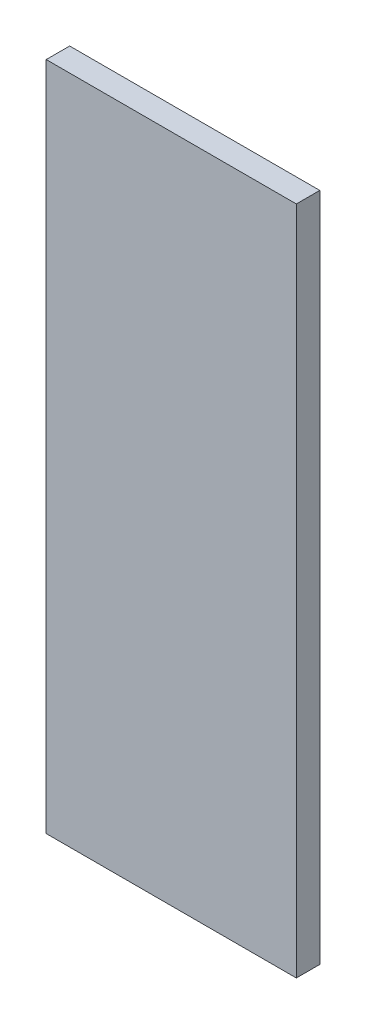
ISO-10303-21;
HEADER;
FILE_DESCRIPTION(('STEP AP214'),'2;1');
FILE_NAME('part.step','',(''),(''),'','','');
FILE_SCHEMA(('AUTOMOTIVE_DESIGN { 1 0 10303 214 1 1 1 1 }'));
ENDSEC;
DATA;
#1=APPLICATION_CONTEXT('core data for automotive mechanical design processes');
#2=APPLICATION_PROTOCOL_DEFINITION('international standard','automotive_design',2000,#1);
#3=PRODUCT_CONTEXT('',#1,'mechanical');
#4=PRODUCT('Part','Part','',(#3));
#5=PRODUCT_RELATED_PRODUCT_CATEGORY('part','',(#4));
#6=PRODUCT_DEFINITION_FORMATION('','',#4);
#7=PRODUCT_DEFINITION_CONTEXT('part definition',#1,'design');
#8=PRODUCT_DEFINITION('design','',#6,#7);
#9=PRODUCT_DEFINITION_SHAPE('','',#8);
#10=(LENGTH_UNIT() NAMED_UNIT(*) SI_UNIT(.MILLI.,.METRE.));
#11=(NAMED_UNIT(*) PLANE_ANGLE_UNIT() SI_UNIT($,.RADIAN.));
#12=(NAMED_UNIT(*) SI_UNIT($,.STERADIAN.) SOLID_ANGLE_UNIT());
#13=UNCERTAINTY_MEASURE_WITH_UNIT(LENGTH_MEASURE(1.E-05),#10,'distance_accuracy_value','');
#14=(GEOMETRIC_REPRESENTATION_CONTEXT(3) GLOBAL_UNCERTAINTY_ASSIGNED_CONTEXT((#13)) GLOBAL_UNIT_ASSIGNED_CONTEXT((#10,
#11,#12)) REPRESENTATION_CONTEXT('',''));
#15=CARTESIAN_POINT('',(0.,0.,0.));
#16=DIRECTION('',(0.,0.,1.));
#17=DIRECTION('',(1.,0.,0.));
#18=AXIS2_PLACEMENT_3D('',#15,#16,#17);
#19=CARTESIAN_POINT('',(0.,544.576,0.));
#20=DIRECTION('',(1.,0.,0.));
#21=DIRECTION('',(0.,0.,-1.));
#22=AXIS2_PLACEMENT_3D('',#19,#20,#21);
#23=PLANE('',#22);
#24=DIRECTION('',(0.,0.,1.));
#25=VECTOR('',#24,1.);
#26=CARTESIAN_POINT('',(0.,0.,0.));
#27=LINE('',#26,#25);
#28=CARTESIAN_POINT('',(0.,0.,-19.05));
#29=VERTEX_POINT('',#28);
#30=CARTESIAN_POINT('',(0.,0.,0.));
#31=VERTEX_POINT('',#30);
#32=EDGE_CURVE('E96',#29,#31,#27,.T.);
#33=ORIENTED_EDGE('',*,*,#32,.T.);
#34=DIRECTION('',(0.,-1.,0.));
#35=VECTOR('',#34,1.);
#36=CARTESIAN_POINT('',(0.,544.576,0.));
#37=LINE('',#36,#35);
#38=CARTESIAN_POINT('',(0.,544.576,0.));
#39=VERTEX_POINT('',#38);
#40=EDGE_CURVE('E11',#39,#31,#37,.T.);
#41=ORIENTED_EDGE('',*,*,#40,.F.);
#42=DIRECTION('',(0.,0.,1.));
#43=VECTOR('',#42,1.);
#44=CARTESIAN_POINT('',(0.,544.576,0.));
#45=LINE('',#44,#43);
#46=CARTESIAN_POINT('',(0.,544.576,-19.05));
#47=VERTEX_POINT('',#46);
#48=EDGE_CURVE('E84',#47,#39,#45,.T.);
#49=ORIENTED_EDGE('',*,*,#48,.F.);
#50=DIRECTION('',(0.,-1.,0.));
#51=VECTOR('',#50,1.);
#52=CARTESIAN_POINT('',(0.,544.576,-19.05));
#53=LINE('',#52,#51);
#54=EDGE_CURVE('E92',#47,#29,#53,.T.);
#55=ORIENTED_EDGE('',*,*,#54,.T.);
#56=EDGE_LOOP('',(#33,#41,#49,#55));
#57=FACE_BOUND('',#56,.T.);
#58=ADVANCED_FACE('F33',(#57),#23,.F.);
#59=CARTESIAN_POINT('',(0.,544.576,0.));
#60=DIRECTION('',(0.,0.,-1.));
#61=DIRECTION('',(-1.,0.,0.));
#62=AXIS2_PLACEMENT_3D('',#59,#60,#61);
#63=PLANE('',#62);
#64=DIRECTION('',(1.,0.,0.));
#65=VECTOR('',#64,1.);
#66=CARTESIAN_POINT('',(0.,0.,0.));
#67=LINE('',#66,#65);
#68=CARTESIAN_POINT('',(203.2,0.,0.));
#69=VERTEX_POINT('',#68);
#70=EDGE_CURVE('E88',#31,#69,#67,.T.);
#71=ORIENTED_EDGE('',*,*,#70,.T.);
#72=DIRECTION('',(0.,-1.,0.));
#73=VECTOR('',#72,1.);
#74=CARTESIAN_POINT('',(203.2,544.576,0.));
#75=LINE('',#74,#73);
#76=CARTESIAN_POINT('',(203.2,544.576,0.));
#77=VERTEX_POINT('',#76);
#78=EDGE_CURVE('E41',#77,#69,#75,.T.);
#79=ORIENTED_EDGE('',*,*,#78,.F.);
#80=DIRECTION('',(1.,0.,0.));
#81=VECTOR('',#80,1.);
#82=CARTESIAN_POINT('',(0.,544.576,0.));
#83=LINE('',#82,#81);
#84=EDGE_CURVE('E79',#39,#77,#83,.T.);
#85=ORIENTED_EDGE('',*,*,#84,.F.);
#86=ORIENTED_EDGE('',*,*,#40,.T.);
#87=EDGE_LOOP('',(#71,#79,#85,#86));
#88=FACE_BOUND('',#87,.T.);
#89=ADVANCED_FACE('F87',(#88),#63,.F.);
#90=CARTESIAN_POINT('',(203.2,544.576,0.));
#91=DIRECTION('',(-1.,0.,0.));
#92=DIRECTION('',(0.,0.,1.));
#93=AXIS2_PLACEMENT_3D('',#90,#91,#92);
#94=PLANE('',#93);
#95=DIRECTION('',(0.,0.,-1.));
#96=VECTOR('',#95,1.);
#97=CARTESIAN_POINT('',(203.2,0.,0.));
#98=LINE('',#97,#96);
#99=CARTESIAN_POINT('',(203.2,0.,-19.05));
#100=VERTEX_POINT('',#99);
#101=EDGE_CURVE('E66',#69,#100,#98,.T.);
#102=ORIENTED_EDGE('',*,*,#101,.T.);
#103=DIRECTION('',(0.,-1.,0.));
#104=VECTOR('',#103,1.);
#105=CARTESIAN_POINT('',(203.2,544.576,-19.05));
#106=LINE('',#105,#104);
#107=CARTESIAN_POINT('',(203.2,544.576,-19.05));
#108=VERTEX_POINT('',#107);
#109=EDGE_CURVE('E89',#108,#100,#106,.T.);
#110=ORIENTED_EDGE('',*,*,#109,.F.);
#111=DIRECTION('',(0.,0.,-1.));
#112=VECTOR('',#111,1.);
#113=CARTESIAN_POINT('',(203.2,544.576,0.));
#114=LINE('',#113,#112);
#115=EDGE_CURVE('E82',#77,#108,#114,.T.);
#116=ORIENTED_EDGE('',*,*,#115,.F.);
#117=ORIENTED_EDGE('',*,*,#78,.T.);
#118=EDGE_LOOP('',(#102,#110,#116,#117));
#119=FACE_BOUND('',#118,.T.);
#120=ADVANCED_FACE('F90',(#119),#94,.F.);
#121=CARTESIAN_POINT('',(0.,544.576,-19.05));
#122=DIRECTION('',(0.,0.,1.));
#123=DIRECTION('',(1.,0.,0.));
#124=AXIS2_PLACEMENT_3D('',#121,#122,#123);
#125=PLANE('',#124);
#126=DIRECTION('',(-1.,0.,0.));
#127=VECTOR('',#126,1.);
#128=CARTESIAN_POINT('',(0.,0.,-19.05));
#129=LINE('',#128,#127);
#130=EDGE_CURVE('E72',#100,#29,#129,.T.);
#131=ORIENTED_EDGE('',*,*,#130,.T.);
#132=ORIENTED_EDGE('',*,*,#54,.F.);
#133=DIRECTION('',(-1.,0.,0.));
#134=VECTOR('',#133,1.);
#135=CARTESIAN_POINT('',(0.,544.576,-19.05));
#136=LINE('',#135,#134);
#137=EDGE_CURVE('E49',#108,#47,#136,.T.);
#138=ORIENTED_EDGE('',*,*,#137,.F.);
#139=ORIENTED_EDGE('',*,*,#109,.T.);
#140=EDGE_LOOP('',(#131,#132,#138,#139));
#141=FACE_BOUND('',#140,.T.);
#142=ADVANCED_FACE('F103',(#141),#125,.F.);
#143=CARTESIAN_POINT('',(0.,544.576,0.));
#144=DIRECTION('',(0.,-1.,0.));
#145=DIRECTION('',(0.,0.,-1.));
#146=AXIS2_PLACEMENT_3D('',#143,#144,#145);
#147=PLANE('',#146);
#148=ORIENTED_EDGE('',*,*,#48,.T.);
#149=ORIENTED_EDGE('',*,*,#84,.T.);
#150=ORIENTED_EDGE('',*,*,#115,.T.);
#151=ORIENTED_EDGE('',*,*,#137,.T.);
#152=EDGE_LOOP('',(#148,#149,#150,#151));
#153=FACE_BOUND('',#152,.T.);
#154=ADVANCED_FACE('F80',(#153),#147,.F.);
#155=CARTESIAN_POINT('',(0.,0.,0.));
#156=DIRECTION('',(0.,-1.,0.));
#157=DIRECTION('',(0.,0.,-1.));
#158=AXIS2_PLACEMENT_3D('',#155,#156,#157);
#159=PLANE('',#158);
#160=ORIENTED_EDGE('',*,*,#32,.F.);
#161=ORIENTED_EDGE('',*,*,#130,.F.);
#162=ORIENTED_EDGE('',*,*,#101,.F.);
#163=ORIENTED_EDGE('',*,*,#70,.F.);
#164=EDGE_LOOP('',(#160,#161,#162,#163));
#165=FACE_BOUND('',#164,.T.);
#166=ADVANCED_FACE('F106',(#165),#159,.T.);
#167=CLOSED_SHELL('',(#58,#89,#120,#142,#154,#166));
#168=MANIFOLD_SOLID_BREP('B2',#167);
#169=ADVANCED_BREP_SHAPE_REPRESENTATION('',(#18,#168),#14);
#170=SHAPE_DEFINITION_REPRESENTATION(#9,#169);
ENDSEC;
END-ISO-10303-21;
